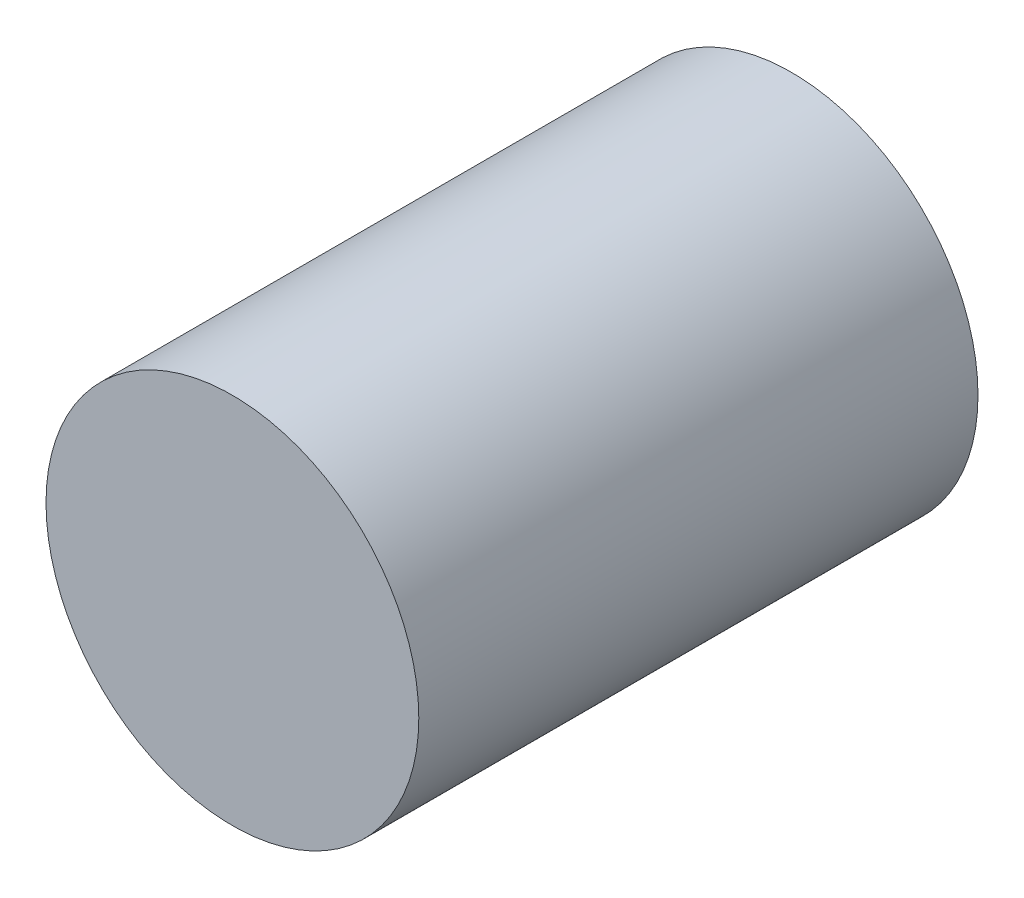
ISO-10303-21;
HEADER;
FILE_DESCRIPTION(('STEP AP214'),'2;1');
FILE_NAME('part.step','',(''),(''),'','','');
FILE_SCHEMA(('AUTOMOTIVE_DESIGN { 1 0 10303 214 1 1 1 1 }'));
ENDSEC;
DATA;
#1=APPLICATION_CONTEXT('core data for automotive mechanical design processes');
#2=APPLICATION_PROTOCOL_DEFINITION('international standard','automotive_design',2000,#1);
#3=PRODUCT_CONTEXT('',#1,'mechanical');
#4=PRODUCT('Part','Part','',(#3));
#5=PRODUCT_RELATED_PRODUCT_CATEGORY('part','',(#4));
#6=PRODUCT_DEFINITION_FORMATION('','',#4);
#7=PRODUCT_DEFINITION_CONTEXT('part definition',#1,'design');
#8=PRODUCT_DEFINITION('design','',#6,#7);
#9=PRODUCT_DEFINITION_SHAPE('','',#8);
#10=(LENGTH_UNIT() NAMED_UNIT(*) SI_UNIT(.MILLI.,.METRE.));
#11=(NAMED_UNIT(*) PLANE_ANGLE_UNIT() SI_UNIT($,.RADIAN.));
#12=(NAMED_UNIT(*) SI_UNIT($,.STERADIAN.) SOLID_ANGLE_UNIT());
#13=UNCERTAINTY_MEASURE_WITH_UNIT(LENGTH_MEASURE(1.E-05),#10,'distance_accuracy_value','');
#14=(GEOMETRIC_REPRESENTATION_CONTEXT(3) GLOBAL_UNCERTAINTY_ASSIGNED_CONTEXT((#13)) GLOBAL_UNIT_ASSIGNED_CONTEXT((#10,
#11,#12)) REPRESENTATION_CONTEXT('',''));
#15=CARTESIAN_POINT('',(0.,0.,0.));
#16=DIRECTION('',(0.,0.,1.));
#17=DIRECTION('',(1.,0.,0.));
#18=AXIS2_PLACEMENT_3D('',#15,#16,#17);
#19=CARTESIAN_POINT('',(0.,0.,37.5));
#20=DIRECTION('',(0.,0.,-1.));
#21=DIRECTION('',(-1.,0.,0.));
#22=AXIS2_PLACEMENT_3D('',#19,#20,#21);
#23=CYLINDRICAL_SURFACE('',#22,25.);
#24=CARTESIAN_POINT('',(0.,0.,37.5));
#25=DIRECTION('',(0.,0.,1.));
#26=DIRECTION('',(1.,0.,0.));
#27=AXIS2_PLACEMENT_3D('',#24,#25,#26);
#28=CIRCLE('',#27,25.);
#29=CARTESIAN_POINT('',(25.,0.,37.5));
#30=VERTEX_POINT('',#29);
#31=EDGE_CURVE('E10',#30,#30,#28,.T.);
#32=ORIENTED_EDGE('',*,*,#31,.F.);
#33=EDGE_LOOP('',(#32));
#34=FACE_BOUND('',#33,.T.);
#35=CARTESIAN_POINT('',(0.,0.,-37.5));
#36=DIRECTION('',(0.,0.,1.));
#37=DIRECTION('',(1.,0.,0.));
#38=AXIS2_PLACEMENT_3D('',#35,#36,#37);
#39=CIRCLE('',#38,25.);
#40=CARTESIAN_POINT('',(25.,0.,-37.5));
#41=VERTEX_POINT('',#40);
#42=EDGE_CURVE('E38',#41,#41,#39,.T.);
#43=ORIENTED_EDGE('',*,*,#42,.T.);
#44=EDGE_LOOP('',(#43));
#45=FACE_BOUND('',#44,.T.);
#46=ADVANCED_FACE('F35',(#34,#45),#23,.T.);
#47=CARTESIAN_POINT('',(0.,0.,37.5));
#48=DIRECTION('',(0.,0.,1.));
#49=DIRECTION('',(1.,0.,0.));
#50=AXIS2_PLACEMENT_3D('',#47,#48,#49);
#51=PLANE('',#50);
#52=ORIENTED_EDGE('',*,*,#31,.T.);
#53=EDGE_LOOP('',(#52));
#54=FACE_BOUND('',#53,.T.);
#55=ADVANCED_FACE('F50',(#54),#51,.T.);
#56=CARTESIAN_POINT('',(0.,0.,-37.5));
#57=DIRECTION('',(0.,0.,1.));
#58=DIRECTION('',(1.,0.,0.));
#59=AXIS2_PLACEMENT_3D('',#56,#57,#58);
#60=PLANE('',#59);
#61=ORIENTED_EDGE('',*,*,#42,.F.);
#62=EDGE_LOOP('',(#61));
#63=FACE_BOUND('',#62,.T.);
#64=ADVANCED_FACE('F48',(#63),#60,.F.);
#65=CLOSED_SHELL('',(#46,#55,#64));
#66=MANIFOLD_SOLID_BREP('B2',#65);
#67=ADVANCED_BREP_SHAPE_REPRESENTATION('',(#18,#66),#14);
#68=SHAPE_DEFINITION_REPRESENTATION(#9,#67);
ENDSEC;
END-ISO-10303-21;
